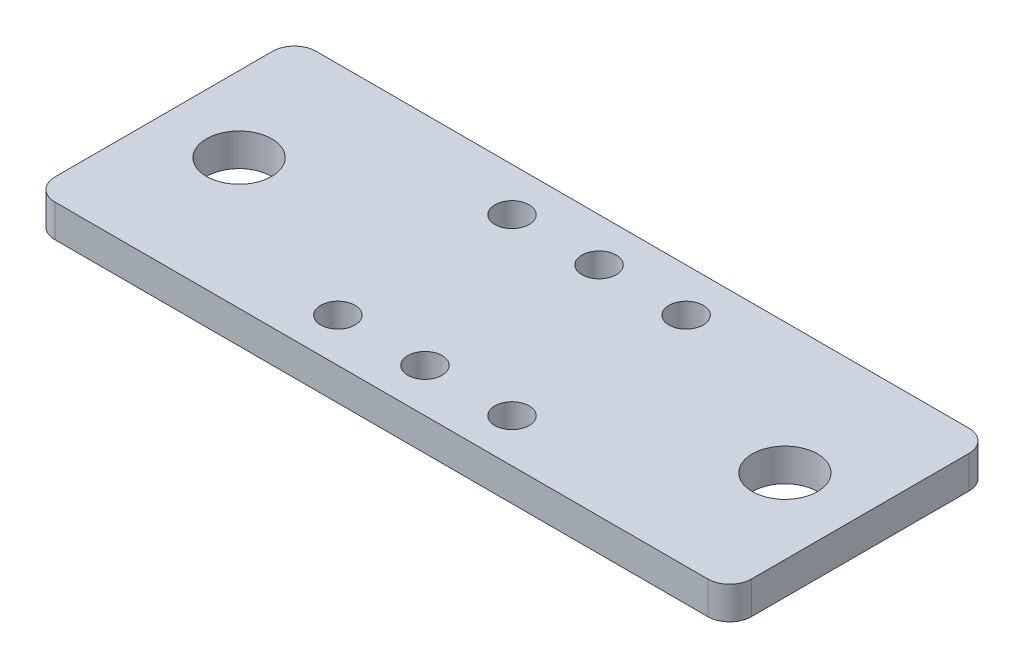
ISO-10303-21;
HEADER;
FILE_DESCRIPTION(('STEP AP214'),'2;1');
FILE_NAME('part.step','',(''),(''),'','','');
FILE_SCHEMA(('AUTOMOTIVE_DESIGN { 1 0 10303 214 1 1 1 1 }'));
ENDSEC;
DATA;
#1=APPLICATION_CONTEXT('core data for automotive mechanical design processes');
#2=APPLICATION_PROTOCOL_DEFINITION('international standard','automotive_design',2000,#1);
#3=PRODUCT_CONTEXT('',#1,'mechanical');
#4=PRODUCT('Part','Part','',(#3));
#5=PRODUCT_RELATED_PRODUCT_CATEGORY('part','',(#4));
#6=PRODUCT_DEFINITION_FORMATION('','',#4);
#7=PRODUCT_DEFINITION_CONTEXT('part definition',#1,'design');
#8=PRODUCT_DEFINITION('design','',#6,#7);
#9=PRODUCT_DEFINITION_SHAPE('','',#8);
#10=(LENGTH_UNIT() NAMED_UNIT(*) SI_UNIT(.MILLI.,.METRE.));
#11=(NAMED_UNIT(*) PLANE_ANGLE_UNIT() SI_UNIT($,.RADIAN.));
#12=(NAMED_UNIT(*) SI_UNIT($,.STERADIAN.) SOLID_ANGLE_UNIT());
#13=UNCERTAINTY_MEASURE_WITH_UNIT(LENGTH_MEASURE(1.E-05),#10,'distance_accuracy_value','');
#14=(GEOMETRIC_REPRESENTATION_CONTEXT(3) GLOBAL_UNCERTAINTY_ASSIGNED_CONTEXT((#13)) GLOBAL_UNIT_ASSIGNED_CONTEXT((#10,
#11,#12)) REPRESENTATION_CONTEXT('',''));
#15=CARTESIAN_POINT('',(0.,0.,0.));
#16=DIRECTION('',(0.,0.,1.));
#17=DIRECTION('',(1.,0.,0.));
#18=AXIS2_PLACEMENT_3D('',#15,#16,#17);
#19=CARTESIAN_POINT('',(-50.8,-4.76,-19.05));
#20=DIRECTION('',(-1.,0.,0.));
#21=DIRECTION('',(0.,0.,1.));
#22=AXIS2_PLACEMENT_3D('',#19,#20,#21);
#23=PLANE('',#22);
#24=DIRECTION('',(0.,0.,1.));
#25=VECTOR('',#24,1.);
#26=CARTESIAN_POINT('',(-50.8,0.,-19.05));
#27=LINE('',#26,#25);
#28=CARTESIAN_POINT('',(-50.8,0.,-15.875));
#29=VERTEX_POINT('',#28);
#30=CARTESIAN_POINT('',(-50.8,0.,15.875));
#31=VERTEX_POINT('',#30);
#32=EDGE_CURVE('E158',#29,#31,#27,.T.);
#33=ORIENTED_EDGE('',*,*,#32,.F.);
#34=DIRECTION('',(0.,1.,0.));
#35=VECTOR('',#34,1.);
#36=CARTESIAN_POINT('',(-50.8,-4.76,-15.875));
#37=LINE('',#36,#35);
#38=CARTESIAN_POINT('',(-50.8,-4.76,-15.875));
#39=VERTEX_POINT('',#38);
#40=EDGE_CURVE('E11',#29,#39,#37,.F.);
#41=ORIENTED_EDGE('',*,*,#40,.T.);
#42=DIRECTION('',(0.,0.,1.));
#43=VECTOR('',#42,1.);
#44=CARTESIAN_POINT('',(-50.8,-4.76,-19.05));
#45=LINE('',#44,#43);
#46=CARTESIAN_POINT('',(-50.8,-4.76,15.875));
#47=VERTEX_POINT('',#46);
#48=EDGE_CURVE('E161',#39,#47,#45,.T.);
#49=ORIENTED_EDGE('',*,*,#48,.T.);
#50=DIRECTION('',(0.,1.,0.));
#51=VECTOR('',#50,1.);
#52=CARTESIAN_POINT('',(-50.8,-4.76,15.875));
#53=LINE('',#52,#51);
#54=EDGE_CURVE('E46',#47,#31,#53,.T.);
#55=ORIENTED_EDGE('',*,*,#54,.T.);
#56=EDGE_LOOP('',(#33,#41,#49,#55));
#57=FACE_BOUND('',#56,.T.);
#58=ADVANCED_FACE('F38',(#57),#23,.T.);
#59=CARTESIAN_POINT('',(50.8,-4.76,-19.05));
#60=DIRECTION('',(0.,0.,-1.));
#61=DIRECTION('',(-1.,0.,0.));
#62=AXIS2_PLACEMENT_3D('',#59,#60,#61);
#63=PLANE('',#62);
#64=DIRECTION('',(-1.,0.,0.));
#65=VECTOR('',#64,1.);
#66=CARTESIAN_POINT('',(50.8,0.,-19.05));
#67=LINE('',#66,#65);
#68=CARTESIAN_POINT('',(47.625,0.,-19.05));
#69=VERTEX_POINT('',#68);
#70=CARTESIAN_POINT('',(-47.625,0.,-19.05));
#71=VERTEX_POINT('',#70);
#72=EDGE_CURVE('E123',#69,#71,#67,.T.);
#73=ORIENTED_EDGE('',*,*,#72,.F.);
#74=DIRECTION('',(0.,1.,0.));
#75=VECTOR('',#74,1.);
#76=CARTESIAN_POINT('',(47.625,-4.76,-19.05));
#77=LINE('',#76,#75);
#78=CARTESIAN_POINT('',(47.625,-4.76,-19.05));
#79=VERTEX_POINT('',#78);
#80=EDGE_CURVE('E141',#69,#79,#77,.F.);
#81=ORIENTED_EDGE('',*,*,#80,.T.);
#82=DIRECTION('',(-1.,0.,0.));
#83=VECTOR('',#82,1.);
#84=CARTESIAN_POINT('',(50.8,-4.76,-19.05));
#85=LINE('',#84,#83);
#86=CARTESIAN_POINT('',(-47.625,-4.76,-19.05));
#87=VERTEX_POINT('',#86);
#88=EDGE_CURVE('E126',#79,#87,#85,.T.);
#89=ORIENTED_EDGE('',*,*,#88,.T.);
#90=DIRECTION('',(0.,1.,0.));
#91=VECTOR('',#90,1.);
#92=CARTESIAN_POINT('',(-47.625,-4.76,-19.05));
#93=LINE('',#92,#91);
#94=EDGE_CURVE('E138',#87,#71,#93,.T.);
#95=ORIENTED_EDGE('',*,*,#94,.T.);
#96=EDGE_LOOP('',(#73,#81,#89,#95));
#97=FACE_BOUND('',#96,.T.);
#98=ADVANCED_FACE('F263',(#97),#63,.T.);
#99=CARTESIAN_POINT('',(50.8,-4.76,-19.05));
#100=DIRECTION('',(1.,0.,0.));
#101=DIRECTION('',(0.,0.,-1.));
#102=AXIS2_PLACEMENT_3D('',#99,#100,#101);
#103=PLANE('',#102);
#104=DIRECTION('',(0.,0.,-1.));
#105=VECTOR('',#104,1.);
#106=CARTESIAN_POINT('',(50.8,-4.76,-19.05));
#107=LINE('',#106,#105);
#108=CARTESIAN_POINT('',(50.8,-4.76,15.875));
#109=VERTEX_POINT('',#108);
#110=CARTESIAN_POINT('',(50.8,-4.76,-15.875));
#111=VERTEX_POINT('',#110);
#112=EDGE_CURVE('E131',#109,#111,#107,.T.);
#113=ORIENTED_EDGE('',*,*,#112,.T.);
#114=DIRECTION('',(0.,1.,0.));
#115=VECTOR('',#114,1.);
#116=CARTESIAN_POINT('',(50.8,-4.76,-15.875));
#117=LINE('',#116,#115);
#118=CARTESIAN_POINT('',(50.8,0.,-15.875));
#119=VERTEX_POINT('',#118);
#120=EDGE_CURVE('E122',#111,#119,#117,.T.);
#121=ORIENTED_EDGE('',*,*,#120,.T.);
#122=DIRECTION('',(0.,0.,-1.));
#123=VECTOR('',#122,1.);
#124=CARTESIAN_POINT('',(50.8,0.,-19.05));
#125=LINE('',#124,#123);
#126=CARTESIAN_POINT('',(50.8,0.,15.875));
#127=VERTEX_POINT('',#126);
#128=EDGE_CURVE('E107',#127,#119,#125,.T.);
#129=ORIENTED_EDGE('',*,*,#128,.F.);
#130=DIRECTION('',(0.,1.,0.));
#131=VECTOR('',#130,1.);
#132=CARTESIAN_POINT('',(50.8,-4.76,15.875));
#133=LINE('',#132,#131);
#134=EDGE_CURVE('E120',#127,#109,#133,.F.);
#135=ORIENTED_EDGE('',*,*,#134,.T.);
#136=EDGE_LOOP('',(#113,#121,#129,#135));
#137=FACE_BOUND('',#136,.T.);
#138=ADVANCED_FACE('F119',(#137),#103,.T.);
#139=CARTESIAN_POINT('',(50.8,-4.76,19.05));
#140=DIRECTION('',(0.,0.,1.));
#141=DIRECTION('',(1.,0.,0.));
#142=AXIS2_PLACEMENT_3D('',#139,#140,#141);
#143=PLANE('',#142);
#144=DIRECTION('',(1.,0.,0.));
#145=VECTOR('',#144,1.);
#146=CARTESIAN_POINT('',(50.8,-4.76,19.05));
#147=LINE('',#146,#145);
#148=CARTESIAN_POINT('',(-47.625,-4.76,19.05));
#149=VERTEX_POINT('',#148);
#150=CARTESIAN_POINT('',(47.625,-4.76,19.05));
#151=VERTEX_POINT('',#150);
#152=EDGE_CURVE('E173',#149,#151,#147,.T.);
#153=ORIENTED_EDGE('',*,*,#152,.T.);
#154=DIRECTION('',(0.,1.,0.));
#155=VECTOR('',#154,1.);
#156=CARTESIAN_POINT('',(47.625,-4.76,19.05));
#157=LINE('',#156,#155);
#158=CARTESIAN_POINT('',(47.625,0.,19.05));
#159=VERTEX_POINT('',#158);
#160=EDGE_CURVE('E151',#151,#159,#157,.T.);
#161=ORIENTED_EDGE('',*,*,#160,.T.);
#162=DIRECTION('',(1.,0.,0.));
#163=VECTOR('',#162,1.);
#164=CARTESIAN_POINT('',(50.8,0.,19.05));
#165=LINE('',#164,#163);
#166=CARTESIAN_POINT('',(-47.625,0.,19.05));
#167=VERTEX_POINT('',#166);
#168=EDGE_CURVE('E108',#167,#159,#165,.T.);
#169=ORIENTED_EDGE('',*,*,#168,.F.);
#170=DIRECTION('',(0.,1.,0.));
#171=VECTOR('',#170,1.);
#172=CARTESIAN_POINT('',(-47.625,-4.76,19.05));
#173=LINE('',#172,#171);
#174=EDGE_CURVE('E60',#167,#149,#173,.F.);
#175=ORIENTED_EDGE('',*,*,#174,.T.);
#176=EDGE_LOOP('',(#153,#161,#169,#175));
#177=FACE_BOUND('',#176,.T.);
#178=ADVANCED_FACE('F272',(#177),#143,.T.);
#179=CARTESIAN_POINT('',(0.,-4.76,0.));
#180=DIRECTION('',(0.,-1.,0.));
#181=DIRECTION('',(0.,0.,-1.));
#182=AXIS2_PLACEMENT_3D('',#179,#180,#181);
#183=PLANE('',#182);
#184=CARTESIAN_POINT('',(0.,-4.76,12.7));
#185=DIRECTION('',(0.,1.,0.));
#186=DIRECTION('',(0.,0.,1.));
#187=AXIS2_PLACEMENT_3D('',#184,#185,#186);
#188=CIRCLE('',#187,2.5);
#189=CARTESIAN_POINT('',(0.,-4.76,15.2));
#190=VERTEX_POINT('',#189);
#191=EDGE_CURVE('E217',#190,#190,#188,.T.);
#192=ORIENTED_EDGE('',*,*,#191,.T.);
#193=EDGE_LOOP('',(#192));
#194=FACE_BOUND('',#193,.T.);
#195=CARTESIAN_POINT('',(12.7,-4.76,12.7));
#196=DIRECTION('',(0.,1.,0.));
#197=DIRECTION('',(0.,0.,1.));
#198=AXIS2_PLACEMENT_3D('',#195,#196,#197);
#199=CIRCLE('',#198,2.5);
#200=CARTESIAN_POINT('',(12.7,-4.76,15.2));
#201=VERTEX_POINT('',#200);
#202=EDGE_CURVE('E211',#201,#201,#199,.T.);
#203=ORIENTED_EDGE('',*,*,#202,.T.);
#204=EDGE_LOOP('',(#203));
#205=FACE_BOUND('',#204,.T.);
#206=CARTESIAN_POINT('',(-12.7,-4.76,12.7));
#207=DIRECTION('',(0.,1.,0.));
#208=DIRECTION('',(0.,0.,1.));
#209=AXIS2_PLACEMENT_3D('',#206,#207,#208);
#210=CIRCLE('',#209,2.5);
#211=CARTESIAN_POINT('',(-12.7,-4.76,15.2));
#212=VERTEX_POINT('',#211);
#213=EDGE_CURVE('E205',#212,#212,#210,.T.);
#214=ORIENTED_EDGE('',*,*,#213,.T.);
#215=EDGE_LOOP('',(#214));
#216=FACE_BOUND('',#215,.T.);
#217=CARTESIAN_POINT('',(-12.7,-4.76,-12.7));
#218=DIRECTION('',(0.,1.,0.));
#219=DIRECTION('',(0.,0.,1.));
#220=AXIS2_PLACEMENT_3D('',#217,#218,#219);
#221=CIRCLE('',#220,2.5);
#222=CARTESIAN_POINT('',(-12.7,-4.76,-10.2));
#223=VERTEX_POINT('',#222);
#224=EDGE_CURVE('E196',#223,#223,#221,.T.);
#225=ORIENTED_EDGE('',*,*,#224,.T.);
#226=EDGE_LOOP('',(#225));
#227=FACE_BOUND('',#226,.T.);
#228=CARTESIAN_POINT('',(0.,-4.76,-12.7));
#229=DIRECTION('',(0.,1.,0.));
#230=DIRECTION('',(0.,0.,1.));
#231=AXIS2_PLACEMENT_3D('',#228,#229,#230);
#232=CIRCLE('',#231,2.5);
#233=CARTESIAN_POINT('',(0.,-4.76,-10.2));
#234=VERTEX_POINT('',#233);
#235=EDGE_CURVE('E190',#234,#234,#232,.T.);
#236=ORIENTED_EDGE('',*,*,#235,.T.);
#237=EDGE_LOOP('',(#236));
#238=FACE_BOUND('',#237,.T.);
#239=CARTESIAN_POINT('',(12.7,-4.76,-12.7));
#240=DIRECTION('',(0.,1.,0.));
#241=DIRECTION('',(0.,0.,1.));
#242=AXIS2_PLACEMENT_3D('',#239,#240,#241);
#243=CIRCLE('',#242,2.5);
#244=CARTESIAN_POINT('',(12.7,-4.76,-10.2));
#245=VERTEX_POINT('',#244);
#246=EDGE_CURVE('E182',#245,#245,#243,.T.);
#247=ORIENTED_EDGE('',*,*,#246,.T.);
#248=EDGE_LOOP('',(#247));
#249=FACE_BOUND('',#248,.T.);
#250=CARTESIAN_POINT('',(39.8145,-4.76,0.));
#251=DIRECTION('',(0.,1.,0.));
#252=DIRECTION('',(0.,0.,-1.));
#253=AXIS2_PLACEMENT_3D('',#250,#251,#252);
#254=CIRCLE('',#253,4.7625);
#255=CARTESIAN_POINT('',(39.8145,-4.76,-4.7625));
#256=VERTEX_POINT('',#255);
#257=EDGE_CURVE('E177',#256,#256,#254,.T.);
#258=ORIENTED_EDGE('',*,*,#257,.T.);
#259=EDGE_LOOP('',(#258));
#260=FACE_BOUND('',#259,.T.);
#261=CARTESIAN_POINT('',(-39.8145,-4.76,0.));
#262=DIRECTION('',(0.,1.,0.));
#263=DIRECTION('',(0.,0.,1.));
#264=AXIS2_PLACEMENT_3D('',#261,#262,#263);
#265=CIRCLE('',#264,4.7625);
#266=CARTESIAN_POINT('',(-39.8145,-4.76,4.7625));
#267=VERTEX_POINT('',#266);
#268=EDGE_CURVE('E165',#267,#267,#265,.T.);
#269=ORIENTED_EDGE('',*,*,#268,.T.);
#270=EDGE_LOOP('',(#269));
#271=FACE_BOUND('',#270,.T.);
#272=ORIENTED_EDGE('',*,*,#88,.F.);
#273=CARTESIAN_POINT('',(47.625,-4.76,-15.875));
#274=DIRECTION('',(0.,-1.,0.));
#275=DIRECTION('',(0.,0.,-1.));
#276=AXIS2_PLACEMENT_3D('',#273,#274,#275);
#277=CIRCLE('',#276,3.175);
#278=EDGE_CURVE('E148',#79,#111,#277,.T.);
#279=ORIENTED_EDGE('',*,*,#278,.T.);
#280=ORIENTED_EDGE('',*,*,#112,.F.);
#281=CARTESIAN_POINT('',(47.625,-4.76,15.875));
#282=DIRECTION('',(0.,-1.,0.));
#283=DIRECTION('',(0.,0.,-1.));
#284=AXIS2_PLACEMENT_3D('',#281,#282,#283);
#285=CIRCLE('',#284,3.175);
#286=EDGE_CURVE('E53',#109,#151,#285,.T.);
#287=ORIENTED_EDGE('',*,*,#286,.T.);
#288=ORIENTED_EDGE('',*,*,#152,.F.);
#289=CARTESIAN_POINT('',(-47.625,-4.76,15.875));
#290=DIRECTION('',(0.,-1.,0.));
#291=DIRECTION('',(0.,0.,-1.));
#292=AXIS2_PLACEMENT_3D('',#289,#290,#291);
#293=CIRCLE('',#292,3.175);
#294=EDGE_CURVE('E143',#149,#47,#293,.T.);
#295=ORIENTED_EDGE('',*,*,#294,.T.);
#296=ORIENTED_EDGE('',*,*,#48,.F.);
#297=CARTESIAN_POINT('',(-47.625,-4.76,-15.875));
#298=DIRECTION('',(0.,-1.,0.));
#299=DIRECTION('',(0.,0.,-1.));
#300=AXIS2_PLACEMENT_3D('',#297,#298,#299);
#301=CIRCLE('',#300,3.175);
#302=EDGE_CURVE('E145',#39,#87,#301,.T.);
#303=ORIENTED_EDGE('',*,*,#302,.T.);
#304=EDGE_LOOP('',(#272,#279,#280,#287,#288,#295,#296,#303));
#305=FACE_BOUND('',#304,.T.);
#306=ADVANCED_FACE('F221',(#194,#205,#216,#227,#238,#249,#260,#271,#305),#183,.T.);
#307=CARTESIAN_POINT('',(0.,0.,0.));
#308=DIRECTION('',(0.,-1.,0.));
#309=DIRECTION('',(0.,0.,-1.));
#310=AXIS2_PLACEMENT_3D('',#307,#308,#309);
#311=PLANE('',#310);
#312=CARTESIAN_POINT('',(0.,0.,12.7));
#313=DIRECTION('',(0.,1.,0.));
#314=DIRECTION('',(0.,0.,1.));
#315=AXIS2_PLACEMENT_3D('',#312,#313,#314);
#316=CIRCLE('',#315,2.5);
#317=CARTESIAN_POINT('',(0.,0.,15.2));
#318=VERTEX_POINT('',#317);
#319=EDGE_CURVE('E214',#318,#318,#316,.T.);
#320=ORIENTED_EDGE('',*,*,#319,.F.);
#321=EDGE_LOOP('',(#320));
#322=FACE_BOUND('',#321,.T.);
#323=CARTESIAN_POINT('',(12.7,0.,12.7));
#324=DIRECTION('',(0.,1.,0.));
#325=DIRECTION('',(0.,0.,1.));
#326=AXIS2_PLACEMENT_3D('',#323,#324,#325);
#327=CIRCLE('',#326,2.5);
#328=CARTESIAN_POINT('',(12.7,0.,15.2));
#329=VERTEX_POINT('',#328);
#330=EDGE_CURVE('E208',#329,#329,#327,.T.);
#331=ORIENTED_EDGE('',*,*,#330,.F.);
#332=EDGE_LOOP('',(#331));
#333=FACE_BOUND('',#332,.T.);
#334=CARTESIAN_POINT('',(-12.7,0.,12.7));
#335=DIRECTION('',(0.,1.,0.));
#336=DIRECTION('',(0.,0.,1.));
#337=AXIS2_PLACEMENT_3D('',#334,#335,#336);
#338=CIRCLE('',#337,2.5);
#339=CARTESIAN_POINT('',(-12.7,0.,15.2));
#340=VERTEX_POINT('',#339);
#341=EDGE_CURVE('E202',#340,#340,#338,.T.);
#342=ORIENTED_EDGE('',*,*,#341,.F.);
#343=EDGE_LOOP('',(#342));
#344=FACE_BOUND('',#343,.T.);
#345=CARTESIAN_POINT('',(-12.7,0.,-12.7));
#346=DIRECTION('',(0.,1.,0.));
#347=DIRECTION('',(0.,0.,1.));
#348=AXIS2_PLACEMENT_3D('',#345,#346,#347);
#349=CIRCLE('',#348,2.5);
#350=CARTESIAN_POINT('',(-12.7,0.,-10.2));
#351=VERTEX_POINT('',#350);
#352=EDGE_CURVE('E199',#351,#351,#349,.T.);
#353=ORIENTED_EDGE('',*,*,#352,.F.);
#354=EDGE_LOOP('',(#353));
#355=FACE_BOUND('',#354,.T.);
#356=CARTESIAN_POINT('',(0.,0.,-12.7));
#357=DIRECTION('',(0.,1.,0.));
#358=DIRECTION('',(0.,0.,1.));
#359=AXIS2_PLACEMENT_3D('',#356,#357,#358);
#360=CIRCLE('',#359,2.5);
#361=CARTESIAN_POINT('',(0.,0.,-10.2));
#362=VERTEX_POINT('',#361);
#363=EDGE_CURVE('E193',#362,#362,#360,.T.);
#364=ORIENTED_EDGE('',*,*,#363,.F.);
#365=EDGE_LOOP('',(#364));
#366=FACE_BOUND('',#365,.T.);
#367=CARTESIAN_POINT('',(12.7,0.,-12.7));
#368=DIRECTION('',(0.,1.,0.));
#369=DIRECTION('',(0.,0.,1.));
#370=AXIS2_PLACEMENT_3D('',#367,#368,#369);
#371=CIRCLE('',#370,2.5);
#372=CARTESIAN_POINT('',(12.7,0.,-10.2));
#373=VERTEX_POINT('',#372);
#374=EDGE_CURVE('E187',#373,#373,#371,.T.);
#375=ORIENTED_EDGE('',*,*,#374,.F.);
#376=EDGE_LOOP('',(#375));
#377=FACE_BOUND('',#376,.T.);
#378=CARTESIAN_POINT('',(39.8145,0.,0.));
#379=DIRECTION('',(0.,1.,0.));
#380=DIRECTION('',(0.,0.,-1.));
#381=AXIS2_PLACEMENT_3D('',#378,#379,#380);
#382=CIRCLE('',#381,4.7625);
#383=CARTESIAN_POINT('',(39.8145,0.,-4.7625));
#384=VERTEX_POINT('',#383);
#385=EDGE_CURVE('E179',#384,#384,#382,.T.);
#386=ORIENTED_EDGE('',*,*,#385,.F.);
#387=EDGE_LOOP('',(#386));
#388=FACE_BOUND('',#387,.T.);
#389=CARTESIAN_POINT('',(-39.8145,0.,0.));
#390=DIRECTION('',(0.,1.,0.));
#391=DIRECTION('',(0.,0.,1.));
#392=AXIS2_PLACEMENT_3D('',#389,#390,#391);
#393=CIRCLE('',#392,4.7625);
#394=CARTESIAN_POINT('',(-39.8145,0.,4.7625));
#395=VERTEX_POINT('',#394);
#396=EDGE_CURVE('E169',#395,#395,#393,.T.);
#397=ORIENTED_EDGE('',*,*,#396,.F.);
#398=EDGE_LOOP('',(#397));
#399=FACE_BOUND('',#398,.T.);
#400=ORIENTED_EDGE('',*,*,#128,.T.);
#401=CARTESIAN_POINT('',(47.625,0.,-15.875));
#402=DIRECTION('',(0.,-1.,0.));
#403=DIRECTION('',(0.,0.,-1.));
#404=AXIS2_PLACEMENT_3D('',#401,#402,#403);
#405=CIRCLE('',#404,3.175);
#406=EDGE_CURVE('E113',#119,#69,#405,.F.);
#407=ORIENTED_EDGE('',*,*,#406,.T.);
#408=ORIENTED_EDGE('',*,*,#72,.T.);
#409=CARTESIAN_POINT('',(-47.625,0.,-15.875));
#410=DIRECTION('',(0.,-1.,0.));
#411=DIRECTION('',(0.,0.,-1.));
#412=AXIS2_PLACEMENT_3D('',#409,#410,#411);
#413=CIRCLE('',#412,3.175);
#414=EDGE_CURVE('E114',#71,#29,#413,.F.);
#415=ORIENTED_EDGE('',*,*,#414,.T.);
#416=ORIENTED_EDGE('',*,*,#32,.T.);
#417=CARTESIAN_POINT('',(-47.625,0.,15.875));
#418=DIRECTION('',(0.,-1.,0.));
#419=DIRECTION('',(0.,0.,-1.));
#420=AXIS2_PLACEMENT_3D('',#417,#418,#419);
#421=CIRCLE('',#420,3.175);
#422=EDGE_CURVE('E128',#31,#167,#421,.F.);
#423=ORIENTED_EDGE('',*,*,#422,.T.);
#424=ORIENTED_EDGE('',*,*,#168,.T.);
#425=CARTESIAN_POINT('',(47.625,0.,15.875));
#426=DIRECTION('',(0.,-1.,0.));
#427=DIRECTION('',(0.,0.,-1.));
#428=AXIS2_PLACEMENT_3D('',#425,#426,#427);
#429=CIRCLE('',#428,3.175);
#430=EDGE_CURVE('E104',#159,#127,#429,.F.);
#431=ORIENTED_EDGE('',*,*,#430,.T.);
#432=EDGE_LOOP('',(#400,#407,#408,#415,#416,#423,#424,#431));
#433=FACE_BOUND('',#432,.T.);
#434=ADVANCED_FACE('F106',(#322,#333,#344,#355,#366,#377,#388,#399,#433),#311,.F.);
#435=CARTESIAN_POINT('',(-39.8145,-4.76,0.));
#436=DIRECTION('',(0.,1.,0.));
#437=DIRECTION('',(0.,0.,1.));
#438=AXIS2_PLACEMENT_3D('',#435,#436,#437);
#439=CYLINDRICAL_SURFACE('',#438,4.7625);
#440=ORIENTED_EDGE('',*,*,#268,.F.);
#441=EDGE_LOOP('',(#440));
#442=FACE_BOUND('',#441,.T.);
#443=ORIENTED_EDGE('',*,*,#396,.T.);
#444=EDGE_LOOP('',(#443));
#445=FACE_BOUND('',#444,.T.);
#446=ADVANCED_FACE('F234',(#442,#445),#439,.F.);
#447=CARTESIAN_POINT('',(39.8145,-4.76,0.));
#448=DIRECTION('',(0.,1.,0.));
#449=DIRECTION('',(0.,0.,1.));
#450=AXIS2_PLACEMENT_3D('',#447,#448,#449);
#451=CYLINDRICAL_SURFACE('',#450,4.7625);
#452=ORIENTED_EDGE('',*,*,#257,.F.);
#453=EDGE_LOOP('',(#452));
#454=FACE_BOUND('',#453,.T.);
#455=ORIENTED_EDGE('',*,*,#385,.T.);
#456=EDGE_LOOP('',(#455));
#457=FACE_BOUND('',#456,.T.);
#458=ADVANCED_FACE('F251',(#454,#457),#451,.F.);
#459=CARTESIAN_POINT('',(12.7,0.,-12.7));
#460=DIRECTION('',(0.,1.,0.));
#461=DIRECTION('',(0.,0.,1.));
#462=AXIS2_PLACEMENT_3D('',#459,#460,#461);
#463=CYLINDRICAL_SURFACE('',#462,2.5);
#464=ORIENTED_EDGE('',*,*,#246,.F.);
#465=EDGE_LOOP('',(#464));
#466=FACE_BOUND('',#465,.T.);
#467=ORIENTED_EDGE('',*,*,#374,.T.);
#468=EDGE_LOOP('',(#467));
#469=FACE_BOUND('',#468,.T.);
#470=ADVANCED_FACE('F257',(#466,#469),#463,.F.);
#471=CARTESIAN_POINT('',(0.,0.,-12.7));
#472=DIRECTION('',(0.,1.,0.));
#473=DIRECTION('',(0.,0.,1.));
#474=AXIS2_PLACEMENT_3D('',#471,#472,#473);
#475=CYLINDRICAL_SURFACE('',#474,2.5);
#476=ORIENTED_EDGE('',*,*,#235,.F.);
#477=EDGE_LOOP('',(#476));
#478=FACE_BOUND('',#477,.T.);
#479=ORIENTED_EDGE('',*,*,#363,.T.);
#480=EDGE_LOOP('',(#479));
#481=FACE_BOUND('',#480,.T.);
#482=ADVANCED_FACE('F343',(#478,#481),#475,.F.);
#483=CARTESIAN_POINT('',(-12.7,0.,-12.7));
#484=DIRECTION('',(0.,1.,0.));
#485=DIRECTION('',(0.,0.,1.));
#486=AXIS2_PLACEMENT_3D('',#483,#484,#485);
#487=CYLINDRICAL_SURFACE('',#486,2.5);
#488=ORIENTED_EDGE('',*,*,#224,.F.);
#489=EDGE_LOOP('',(#488));
#490=FACE_BOUND('',#489,.T.);
#491=ORIENTED_EDGE('',*,*,#352,.T.);
#492=EDGE_LOOP('',(#491));
#493=FACE_BOUND('',#492,.T.);
#494=ADVANCED_FACE('F333',(#490,#493),#487,.F.);
#495=CARTESIAN_POINT('',(-12.7,0.,12.7));
#496=DIRECTION('',(0.,1.,0.));
#497=DIRECTION('',(0.,0.,1.));
#498=AXIS2_PLACEMENT_3D('',#495,#496,#497);
#499=CYLINDRICAL_SURFACE('',#498,2.5);
#500=ORIENTED_EDGE('',*,*,#213,.F.);
#501=EDGE_LOOP('',(#500));
#502=FACE_BOUND('',#501,.T.);
#503=ORIENTED_EDGE('',*,*,#341,.T.);
#504=EDGE_LOOP('',(#503));
#505=FACE_BOUND('',#504,.T.);
#506=ADVANCED_FACE('F323',(#502,#505),#499,.F.);
#507=CARTESIAN_POINT('',(12.7,0.,12.7));
#508=DIRECTION('',(0.,1.,0.));
#509=DIRECTION('',(0.,0.,1.));
#510=AXIS2_PLACEMENT_3D('',#507,#508,#509);
#511=CYLINDRICAL_SURFACE('',#510,2.5);
#512=ORIENTED_EDGE('',*,*,#202,.F.);
#513=EDGE_LOOP('',(#512));
#514=FACE_BOUND('',#513,.T.);
#515=ORIENTED_EDGE('',*,*,#330,.T.);
#516=EDGE_LOOP('',(#515));
#517=FACE_BOUND('',#516,.T.);
#518=ADVANCED_FACE('F228',(#514,#517),#511,.F.);
#519=CARTESIAN_POINT('',(0.,0.,12.7));
#520=DIRECTION('',(0.,1.,0.));
#521=DIRECTION('',(0.,0.,1.));
#522=AXIS2_PLACEMENT_3D('',#519,#520,#521);
#523=CYLINDRICAL_SURFACE('',#522,2.5);
#524=ORIENTED_EDGE('',*,*,#191,.F.);
#525=EDGE_LOOP('',(#524));
#526=FACE_BOUND('',#525,.T.);
#527=ORIENTED_EDGE('',*,*,#319,.T.);
#528=EDGE_LOOP('',(#527));
#529=FACE_BOUND('',#528,.T.);
#530=ADVANCED_FACE('F224',(#526,#529),#523,.F.);
#531=CARTESIAN_POINT('',(47.625,-4.76,-15.875));
#532=DIRECTION('',(0.,1.,0.));
#533=DIRECTION('',(0.,0.,1.));
#534=AXIS2_PLACEMENT_3D('',#531,#532,#533);
#535=CYLINDRICAL_SURFACE('',#534,3.175);
#536=ORIENTED_EDGE('',*,*,#278,.F.);
#537=ORIENTED_EDGE('',*,*,#80,.F.);
#538=ORIENTED_EDGE('',*,*,#406,.F.);
#539=ORIENTED_EDGE('',*,*,#120,.F.);
#540=EDGE_LOOP('',(#536,#537,#538,#539));
#541=FACE_BOUND('',#540,.T.);
#542=ADVANCED_FACE('F227',(#541),#535,.T.);
#543=CARTESIAN_POINT('',(47.625,-4.76,15.875));
#544=DIRECTION('',(0.,1.,0.));
#545=DIRECTION('',(0.,0.,1.));
#546=AXIS2_PLACEMENT_3D('',#543,#544,#545);
#547=CYLINDRICAL_SURFACE('',#546,3.175);
#548=ORIENTED_EDGE('',*,*,#286,.F.);
#549=ORIENTED_EDGE('',*,*,#134,.F.);
#550=ORIENTED_EDGE('',*,*,#430,.F.);
#551=ORIENTED_EDGE('',*,*,#160,.F.);
#552=EDGE_LOOP('',(#548,#549,#550,#551));
#553=FACE_BOUND('',#552,.T.);
#554=ADVANCED_FACE('F125',(#553),#547,.T.);
#555=CARTESIAN_POINT('',(-47.625,-4.76,-15.875));
#556=DIRECTION('',(0.,1.,0.));
#557=DIRECTION('',(0.,0.,1.));
#558=AXIS2_PLACEMENT_3D('',#555,#556,#557);
#559=CYLINDRICAL_SURFACE('',#558,3.175);
#560=ORIENTED_EDGE('',*,*,#302,.F.);
#561=ORIENTED_EDGE('',*,*,#40,.F.);
#562=ORIENTED_EDGE('',*,*,#414,.F.);
#563=ORIENTED_EDGE('',*,*,#94,.F.);
#564=EDGE_LOOP('',(#560,#561,#562,#563));
#565=FACE_BOUND('',#564,.T.);
#566=ADVANCED_FACE('F278',(#565),#559,.T.);
#567=CARTESIAN_POINT('',(-47.625,-4.76,15.875));
#568=DIRECTION('',(0.,1.,0.));
#569=DIRECTION('',(0.,0.,1.));
#570=AXIS2_PLACEMENT_3D('',#567,#568,#569);
#571=CYLINDRICAL_SURFACE('',#570,3.175);
#572=ORIENTED_EDGE('',*,*,#294,.F.);
#573=ORIENTED_EDGE('',*,*,#174,.F.);
#574=ORIENTED_EDGE('',*,*,#422,.F.);
#575=ORIENTED_EDGE('',*,*,#54,.F.);
#576=EDGE_LOOP('',(#572,#573,#574,#575));
#577=FACE_BOUND('',#576,.T.);
#578=ADVANCED_FACE('F40',(#577),#571,.T.);
#579=CLOSED_SHELL('',(#58,#98,#138,#178,#306,#434,#446,#458,#470,#482,#494,#506,#518,#530,#542,
#554,#566,#578));
#580=MANIFOLD_SOLID_BREP('B2',#579);
#581=ADVANCED_BREP_SHAPE_REPRESENTATION('',(#18,#580),#14);
#582=SHAPE_DEFINITION_REPRESENTATION(#9,#581);
ENDSEC;
END-ISO-10303-21;
